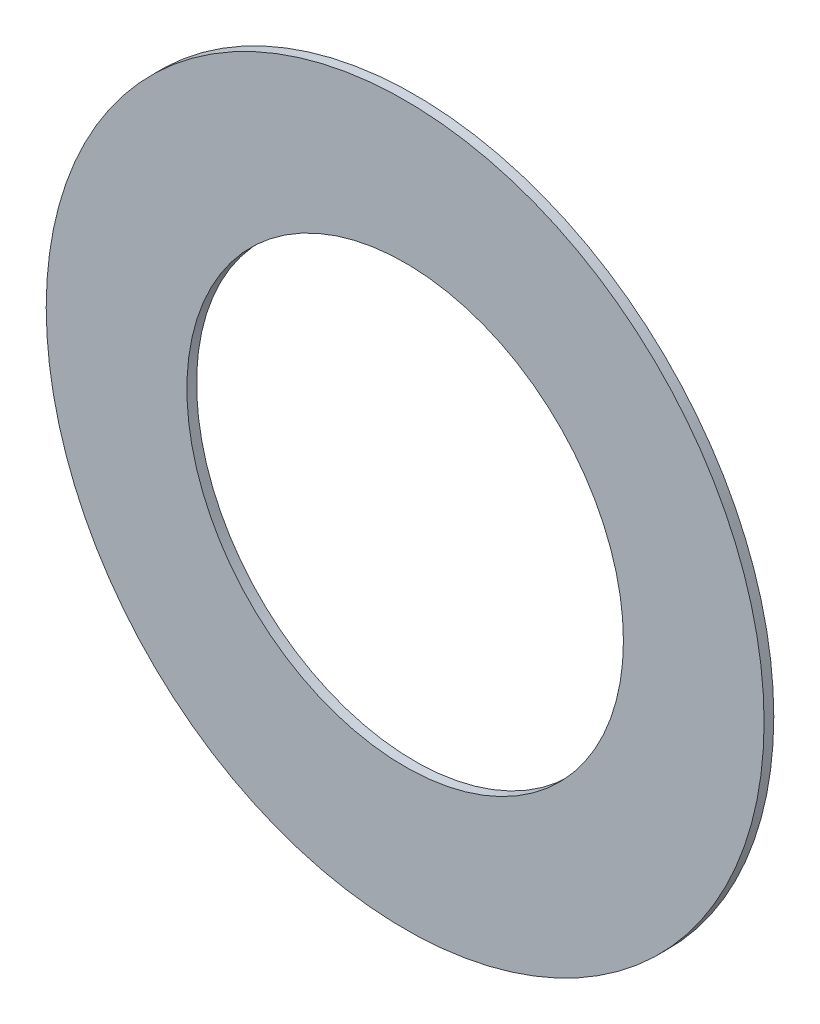
ISO-10303-21;
HEADER;
FILE_DESCRIPTION(('STEP AP214'),'2;1');
FILE_NAME('part.step','',(''),(''),'','','');
FILE_SCHEMA(('AUTOMOTIVE_DESIGN { 1 0 10303 214 1 1 1 1 }'));
ENDSEC;
DATA;
#1=APPLICATION_CONTEXT('core data for automotive mechanical design processes');
#2=APPLICATION_PROTOCOL_DEFINITION('international standard','automotive_design',2000,#1);
#3=PRODUCT_CONTEXT('',#1,'mechanical');
#4=PRODUCT('Part','Part','',(#3));
#5=PRODUCT_RELATED_PRODUCT_CATEGORY('part','',(#4));
#6=PRODUCT_DEFINITION_FORMATION('','',#4);
#7=PRODUCT_DEFINITION_CONTEXT('part definition',#1,'design');
#8=PRODUCT_DEFINITION('design','',#6,#7);
#9=PRODUCT_DEFINITION_SHAPE('','',#8);
#10=(LENGTH_UNIT() NAMED_UNIT(*) SI_UNIT(.MILLI.,.METRE.));
#11=(NAMED_UNIT(*) PLANE_ANGLE_UNIT() SI_UNIT($,.RADIAN.));
#12=(NAMED_UNIT(*) SI_UNIT($,.STERADIAN.) SOLID_ANGLE_UNIT());
#13=UNCERTAINTY_MEASURE_WITH_UNIT(LENGTH_MEASURE(1.E-05),#10,'distance_accuracy_value','');
#14=(GEOMETRIC_REPRESENTATION_CONTEXT(3) GLOBAL_UNCERTAINTY_ASSIGNED_CONTEXT((#13)) GLOBAL_UNIT_ASSIGNED_CONTEXT((#10,
#11,#12)) REPRESENTATION_CONTEXT('',''));
#15=CARTESIAN_POINT('',(0.,0.,0.));
#16=DIRECTION('',(0.,0.,1.));
#17=DIRECTION('',(1.,0.,0.));
#18=AXIS2_PLACEMENT_3D('',#15,#16,#17);
#19=CARTESIAN_POINT('',(0.,0.,1.));
#20=DIRECTION('',(0.,0.,1.));
#21=DIRECTION('',(1.,0.,0.));
#22=AXIS2_PLACEMENT_3D('',#19,#20,#21);
#23=PLANE('',#22);
#24=CARTESIAN_POINT('',(0.,0.,1.));
#25=DIRECTION('',(0.,0.,1.));
#26=DIRECTION('',(1.,0.,0.));
#27=AXIS2_PLACEMENT_3D('',#24,#25,#26);
#28=CIRCLE('',#27,37.);
#29=CARTESIAN_POINT('',(37.,0.,1.));
#30=VERTEX_POINT('',#29);
#31=EDGE_CURVE('E10',#30,#30,#28,.T.);
#32=ORIENTED_EDGE('',*,*,#31,.T.);
#33=EDGE_LOOP('',(#32));
#34=FACE_BOUND('',#33,.T.);
#35=CARTESIAN_POINT('',(0.,0.,1.));
#36=DIRECTION('',(0.,0.,1.));
#37=DIRECTION('',(1.,0.,0.));
#38=AXIS2_PLACEMENT_3D('',#35,#36,#37);
#39=CIRCLE('',#38,22.5);
#40=CARTESIAN_POINT('',(22.5,0.,1.));
#41=VERTEX_POINT('',#40);
#42=EDGE_CURVE('E42',#41,#41,#39,.T.);
#43=ORIENTED_EDGE('',*,*,#42,.F.);
#44=EDGE_LOOP('',(#43));
#45=FACE_BOUND('',#44,.T.);
#46=ADVANCED_FACE('F31',(#34,#45),#23,.T.);
#47=CARTESIAN_POINT('',(0.,0.,0.));
#48=DIRECTION('',(0.,0.,1.));
#49=DIRECTION('',(1.,0.,0.));
#50=AXIS2_PLACEMENT_3D('',#47,#48,#49);
#51=PLANE('',#50);
#52=CARTESIAN_POINT('',(0.,0.,0.));
#53=DIRECTION('',(0.,0.,1.));
#54=DIRECTION('',(1.,0.,0.));
#55=AXIS2_PLACEMENT_3D('',#52,#53,#54);
#56=CIRCLE('',#55,37.);
#57=CARTESIAN_POINT('',(37.,0.,0.));
#58=VERTEX_POINT('',#57);
#59=EDGE_CURVE('E35',#58,#58,#56,.T.);
#60=ORIENTED_EDGE('',*,*,#59,.F.);
#61=EDGE_LOOP('',(#60));
#62=FACE_BOUND('',#61,.T.);
#63=CARTESIAN_POINT('',(0.,0.,0.));
#64=DIRECTION('',(0.,0.,1.));
#65=DIRECTION('',(1.,0.,0.));
#66=AXIS2_PLACEMENT_3D('',#63,#64,#65);
#67=CIRCLE('',#66,22.5);
#68=CARTESIAN_POINT('',(22.5,0.,0.));
#69=VERTEX_POINT('',#68);
#70=EDGE_CURVE('E44',#69,#69,#67,.T.);
#71=ORIENTED_EDGE('',*,*,#70,.T.);
#72=EDGE_LOOP('',(#71));
#73=FACE_BOUND('',#72,.T.);
#74=ADVANCED_FACE('F54',(#62,#73),#51,.F.);
#75=CARTESIAN_POINT('',(0.,0.,1.));
#76=DIRECTION('',(0.,0.,-1.));
#77=DIRECTION('',(-1.,0.,0.));
#78=AXIS2_PLACEMENT_3D('',#75,#76,#77);
#79=CYLINDRICAL_SURFACE('',#78,37.);
#80=ORIENTED_EDGE('',*,*,#31,.F.);
#81=EDGE_LOOP('',(#80));
#82=FACE_BOUND('',#81,.T.);
#83=ORIENTED_EDGE('',*,*,#59,.T.);
#84=EDGE_LOOP('',(#83));
#85=FACE_BOUND('',#84,.T.);
#86=ADVANCED_FACE('F33',(#82,#85),#79,.T.);
#87=CARTESIAN_POINT('',(0.,0.,1.));
#88=DIRECTION('',(0.,0.,-1.));
#89=DIRECTION('',(-1.,0.,0.));
#90=AXIS2_PLACEMENT_3D('',#87,#88,#89);
#91=CYLINDRICAL_SURFACE('',#90,22.5);
#92=ORIENTED_EDGE('',*,*,#42,.T.);
#93=EDGE_LOOP('',(#92));
#94=FACE_BOUND('',#93,.T.);
#95=ORIENTED_EDGE('',*,*,#70,.F.);
#96=EDGE_LOOP('',(#95));
#97=FACE_BOUND('',#96,.T.);
#98=ADVANCED_FACE('F50',(#94,#97),#91,.F.);
#99=CLOSED_SHELL('',(#46,#74,#86,#98));
#100=MANIFOLD_SOLID_BREP('B2',#99);
#101=ADVANCED_BREP_SHAPE_REPRESENTATION('',(#18,#100),#14);
#102=SHAPE_DEFINITION_REPRESENTATION(#9,#101);
ENDSEC;
END-ISO-10303-21;
